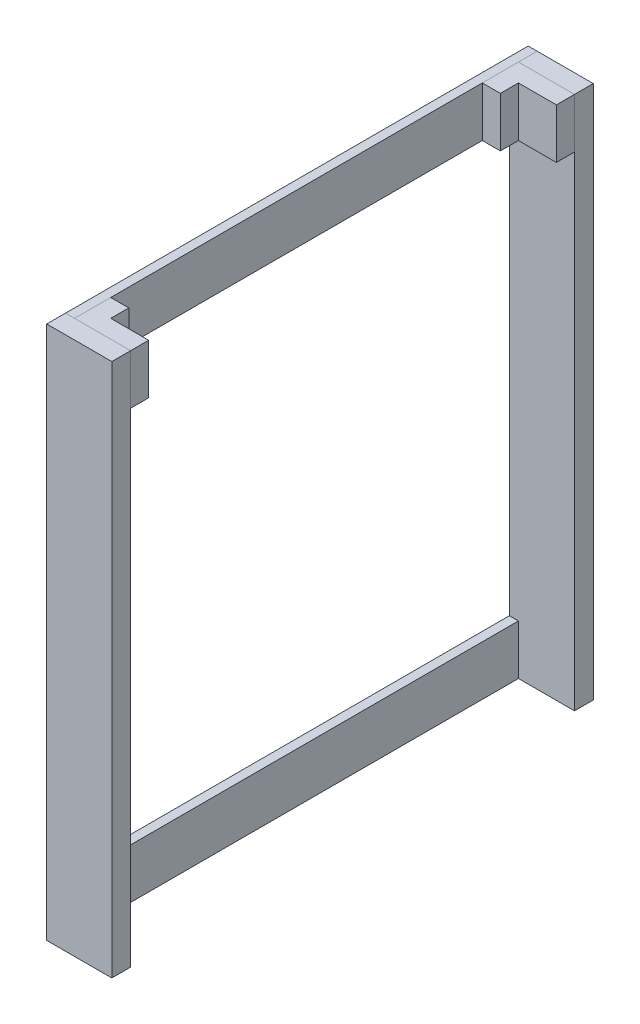
ISO-10303-21;
HEADER;
FILE_DESCRIPTION(('STEP AP214'),'2;1');
FILE_NAME('part.step','',(''),(''),'','','');
FILE_SCHEMA(('AUTOMOTIVE_DESIGN { 1 0 10303 214 1 1 1 1 }'));
ENDSEC;
DATA;
#1=APPLICATION_CONTEXT('core data for automotive mechanical design processes');
#2=APPLICATION_PROTOCOL_DEFINITION('international standard','automotive_design',2000,#1);
#3=PRODUCT_CONTEXT('',#1,'mechanical');
#4=PRODUCT('Part','Part','',(#3));
#5=PRODUCT_RELATED_PRODUCT_CATEGORY('part','',(#4));
#6=PRODUCT_DEFINITION_FORMATION('','',#4);
#7=PRODUCT_DEFINITION_CONTEXT('part definition',#1,'design');
#8=PRODUCT_DEFINITION('design','',#6,#7);
#9=PRODUCT_DEFINITION_SHAPE('','',#8);
#10=(LENGTH_UNIT() NAMED_UNIT(*) SI_UNIT(.MILLI.,.METRE.));
#11=(NAMED_UNIT(*) PLANE_ANGLE_UNIT() SI_UNIT($,.RADIAN.));
#12=(NAMED_UNIT(*) SI_UNIT($,.STERADIAN.) SOLID_ANGLE_UNIT());
#13=UNCERTAINTY_MEASURE_WITH_UNIT(LENGTH_MEASURE(1.E-05),#10,'distance_accuracy_value','');
#14=(GEOMETRIC_REPRESENTATION_CONTEXT(3) GLOBAL_UNCERTAINTY_ASSIGNED_CONTEXT((#13)) GLOBAL_UNIT_ASSIGNED_CONTEXT((#10,
#11,#12)) REPRESENTATION_CONTEXT('',''));
#15=CARTESIAN_POINT('',(0.,0.,0.));
#16=DIRECTION('',(0.,0.,1.));
#17=DIRECTION('',(1.,0.,0.));
#18=AXIS2_PLACEMENT_3D('',#15,#16,#17);
#19=CARTESIAN_POINT('',(-610.,-192.729333728484,307.));
#20=DIRECTION('',(1.,0.,0.));
#21=DIRECTION('',(0.,0.,-1.));
#22=AXIS2_PLACEMENT_3D('',#19,#20,#21);
#23=PLANE('',#22);
#24=DIRECTION('',(0.,0.,1.));
#25=VECTOR('',#24,1.);
#26=CARTESIAN_POINT('',(-610.,-100.5,307.));
#27=LINE('',#26,#25);
#28=CARTESIAN_POINT('',(-610.,-100.5,282.));
#29=VERTEX_POINT('',#28);
#30=CARTESIAN_POINT('',(-610.,-100.5,307.));
#31=VERTEX_POINT('',#30);
#32=EDGE_CURVE('E53',#29,#31,#27,.T.);
#33=ORIENTED_EDGE('',*,*,#32,.F.);
#34=DIRECTION('',(0.,1.,0.));
#35=VECTOR('',#34,1.);
#36=CARTESIAN_POINT('',(-610.,-192.729333728484,282.));
#37=LINE('',#36,#35);
#38=CARTESIAN_POINT('',(-610.,-31.5,282.));
#39=VERTEX_POINT('',#38);
#40=EDGE_CURVE('E109',#29,#39,#37,.T.);
#41=ORIENTED_EDGE('',*,*,#40,.T.);
#42=DIRECTION('',(0.,0.,-1.));
#43=VECTOR('',#42,1.);
#44=CARTESIAN_POINT('',(-610.,-31.5,307.));
#45=LINE('',#44,#43);
#46=CARTESIAN_POINT('',(-610.,-31.5,307.));
#47=VERTEX_POINT('',#46);
#48=EDGE_CURVE('E134',#47,#39,#45,.T.);
#49=ORIENTED_EDGE('',*,*,#48,.F.);
#50=DIRECTION('',(0.,1.,0.));
#51=VECTOR('',#50,1.);
#52=CARTESIAN_POINT('',(-610.,-192.729333728484,307.));
#53=LINE('',#52,#51);
#54=EDGE_CURVE('E102',#31,#47,#53,.T.);
#55=ORIENTED_EDGE('',*,*,#54,.F.);
#56=EDGE_LOOP('',(#33,#41,#49,#55));
#57=FACE_BOUND('',#56,.T.);
#58=ADVANCED_FACE('F45',(#57),#23,.T.);
#59=CARTESIAN_POINT('',(-610.,-192.729333728484,307.));
#60=DIRECTION('',(0.,0.,1.));
#61=DIRECTION('',(1.,0.,0.));
#62=AXIS2_PLACEMENT_3D('',#59,#60,#61);
#63=PLANE('',#62);
#64=DIRECTION('',(-1.,0.,0.));
#65=VECTOR('',#64,1.);
#66=CARTESIAN_POINT('',(-610.,-100.5,307.));
#67=LINE('',#66,#65);
#68=CARTESIAN_POINT('',(-687.5,-100.5,307.));
#69=VERTEX_POINT('',#68);
#70=EDGE_CURVE('E78',#31,#69,#67,.T.);
#71=ORIENTED_EDGE('',*,*,#70,.F.);
#72=ORIENTED_EDGE('',*,*,#54,.T.);
#73=DIRECTION('',(1.,0.,0.));
#74=VECTOR('',#73,1.);
#75=CARTESIAN_POINT('',(-610.,-31.5,307.));
#76=LINE('',#75,#74);
#77=CARTESIAN_POINT('',(-687.5,-31.5,307.));
#78=VERTEX_POINT('',#77);
#79=EDGE_CURVE('E111',#78,#47,#76,.T.);
#80=ORIENTED_EDGE('',*,*,#79,.F.);
#81=DIRECTION('',(0.,1.,0.));
#82=VECTOR('',#81,1.);
#83=CARTESIAN_POINT('',(-687.5,-192.729333728484,307.));
#84=LINE('',#83,#82);
#85=EDGE_CURVE('E100',#69,#78,#84,.T.);
#86=ORIENTED_EDGE('',*,*,#85,.F.);
#87=EDGE_LOOP('',(#71,#72,#80,#86));
#88=FACE_BOUND('',#87,.T.);
#89=ADVANCED_FACE('F152',(#88),#63,.T.);
#90=CARTESIAN_POINT('',(-687.5,-192.729333728484,307.));
#91=DIRECTION('',(-1.,0.,0.));
#92=DIRECTION('',(0.,0.,1.));
#93=AXIS2_PLACEMENT_3D('',#90,#91,#92);
#94=PLANE('',#93);
#95=DIRECTION('',(0.,0.,-1.));
#96=VECTOR('',#95,1.);
#97=CARTESIAN_POINT('',(-687.5,-100.5,307.));
#98=LINE('',#97,#96);
#99=CARTESIAN_POINT('',(-687.5,-100.5,257.));
#100=VERTEX_POINT('',#99);
#101=EDGE_CURVE('E72',#69,#100,#98,.T.);
#102=ORIENTED_EDGE('',*,*,#101,.F.);
#103=ORIENTED_EDGE('',*,*,#85,.T.);
#104=DIRECTION('',(0.,0.,1.));
#105=VECTOR('',#104,1.);
#106=CARTESIAN_POINT('',(-687.5,-31.5,307.));
#107=LINE('',#106,#105);
#108=CARTESIAN_POINT('',(-687.5,-31.5,257.));
#109=VERTEX_POINT('',#108);
#110=EDGE_CURVE('E98',#109,#78,#107,.T.);
#111=ORIENTED_EDGE('',*,*,#110,.F.);
#112=DIRECTION('',(0.,1.,0.));
#113=VECTOR('',#112,1.);
#114=CARTESIAN_POINT('',(-687.5,-192.729333728484,257.));
#115=LINE('',#114,#113);
#116=EDGE_CURVE('E90',#100,#109,#115,.T.);
#117=ORIENTED_EDGE('',*,*,#116,.F.);
#118=EDGE_LOOP('',(#102,#103,#111,#117));
#119=FACE_BOUND('',#118,.T.);
#120=ADVANCED_FACE('F96',(#119),#94,.T.);
#121=CARTESIAN_POINT('',(-687.5,-192.729333728484,257.));
#122=DIRECTION('',(0.,0.,-1.));
#123=DIRECTION('',(-1.,0.,0.));
#124=AXIS2_PLACEMENT_3D('',#121,#122,#123);
#125=PLANE('',#124);
#126=DIRECTION('',(1.,0.,0.));
#127=VECTOR('',#126,1.);
#128=CARTESIAN_POINT('',(-687.5,-100.5,257.));
#129=LINE('',#128,#127);
#130=CARTESIAN_POINT('',(-662.5,-100.5,257.));
#131=VERTEX_POINT('',#130);
#132=EDGE_CURVE('E75',#100,#131,#129,.T.);
#133=ORIENTED_EDGE('',*,*,#132,.F.);
#134=ORIENTED_EDGE('',*,*,#116,.T.);
#135=DIRECTION('',(-1.,0.,0.));
#136=VECTOR('',#135,1.);
#137=CARTESIAN_POINT('',(-687.5,-31.5,257.));
#138=LINE('',#137,#136);
#139=CARTESIAN_POINT('',(-662.5,-31.5,257.));
#140=VERTEX_POINT('',#139);
#141=EDGE_CURVE('E123',#140,#109,#138,.T.);
#142=ORIENTED_EDGE('',*,*,#141,.F.);
#143=DIRECTION('',(0.,1.,0.));
#144=VECTOR('',#143,1.);
#145=CARTESIAN_POINT('',(-662.5,-192.729333728484,257.));
#146=LINE('',#145,#144);
#147=EDGE_CURVE('E93',#131,#140,#146,.T.);
#148=ORIENTED_EDGE('',*,*,#147,.F.);
#149=EDGE_LOOP('',(#133,#134,#142,#148));
#150=FACE_BOUND('',#149,.T.);
#151=ADVANCED_FACE('F87',(#150),#125,.T.);
#152=CARTESIAN_POINT('',(-662.5,-192.729333728484,257.));
#153=DIRECTION('',(1.,0.,0.));
#154=DIRECTION('',(0.,0.,-1.));
#155=AXIS2_PLACEMENT_3D('',#152,#153,#154);
#156=PLANE('',#155);
#157=DIRECTION('',(0.,0.,1.));
#158=VECTOR('',#157,1.);
#159=CARTESIAN_POINT('',(-662.5,-100.5,257.));
#160=LINE('',#159,#158);
#161=CARTESIAN_POINT('',(-662.5,-100.5,282.));
#162=VERTEX_POINT('',#161);
#163=EDGE_CURVE('E94',#131,#162,#160,.T.);
#164=ORIENTED_EDGE('',*,*,#163,.F.);
#165=ORIENTED_EDGE('',*,*,#147,.T.);
#166=DIRECTION('',(0.,0.,-1.));
#167=VECTOR('',#166,1.);
#168=CARTESIAN_POINT('',(-662.5,-31.5,257.));
#169=LINE('',#168,#167);
#170=CARTESIAN_POINT('',(-662.5,-31.5,282.));
#171=VERTEX_POINT('',#170);
#172=EDGE_CURVE('E139',#171,#140,#169,.T.);
#173=ORIENTED_EDGE('',*,*,#172,.F.);
#174=DIRECTION('',(0.,1.,0.));
#175=VECTOR('',#174,1.);
#176=CARTESIAN_POINT('',(-662.5,-192.729333728484,282.));
#177=LINE('',#176,#175);
#178=EDGE_CURVE('E104',#162,#171,#177,.T.);
#179=ORIENTED_EDGE('',*,*,#178,.F.);
#180=EDGE_LOOP('',(#164,#165,#173,#179));
#181=FACE_BOUND('',#180,.T.);
#182=ADVANCED_FACE('F155',(#181),#156,.T.);
#183=CARTESIAN_POINT('',(-610.,-192.729333728484,282.));
#184=DIRECTION('',(0.,0.,-1.));
#185=DIRECTION('',(-1.,0.,0.));
#186=AXIS2_PLACEMENT_3D('',#183,#184,#185);
#187=PLANE('',#186);
#188=DIRECTION('',(1.,0.,0.));
#189=VECTOR('',#188,1.);
#190=CARTESIAN_POINT('',(-610.,-100.5,282.));
#191=LINE('',#190,#189);
#192=EDGE_CURVE('E13',#162,#29,#191,.T.);
#193=ORIENTED_EDGE('',*,*,#192,.F.);
#194=ORIENTED_EDGE('',*,*,#178,.T.);
#195=DIRECTION('',(-1.,0.,0.));
#196=VECTOR('',#195,1.);
#197=CARTESIAN_POINT('',(-610.,-31.5,282.));
#198=LINE('',#197,#196);
#199=EDGE_CURVE('E136',#39,#171,#198,.T.);
#200=ORIENTED_EDGE('',*,*,#199,.F.);
#201=ORIENTED_EDGE('',*,*,#40,.F.);
#202=EDGE_LOOP('',(#193,#194,#200,#201));
#203=FACE_BOUND('',#202,.T.);
#204=ADVANCED_FACE('F154',(#203),#187,.T.);
#205=CARTESIAN_POINT('',(-610.,-31.5,282.));
#206=DIRECTION('',(0.,1.,0.));
#207=DIRECTION('',(0.,0.,1.));
#208=AXIS2_PLACEMENT_3D('',#205,#206,#207);
#209=PLANE('',#208);
#210=ORIENTED_EDGE('',*,*,#48,.T.);
#211=ORIENTED_EDGE('',*,*,#199,.T.);
#212=ORIENTED_EDGE('',*,*,#172,.T.);
#213=ORIENTED_EDGE('',*,*,#141,.T.);
#214=ORIENTED_EDGE('',*,*,#110,.T.);
#215=ORIENTED_EDGE('',*,*,#79,.T.);
#216=EDGE_LOOP('',(#210,#211,#212,#213,#214,#215));
#217=FACE_BOUND('',#216,.T.);
#218=ADVANCED_FACE('F141',(#217),#209,.T.);
#219=CARTESIAN_POINT('',(-700.,-100.5,403.123106035029));
#220=DIRECTION('',(0.,1.,0.));
#221=DIRECTION('',(0.,0.,1.));
#222=AXIS2_PLACEMENT_3D('',#219,#220,#221);
#223=PLANE('',#222);
#224=ORIENTED_EDGE('',*,*,#32,.T.);
#225=ORIENTED_EDGE('',*,*,#70,.T.);
#226=ORIENTED_EDGE('',*,*,#101,.T.);
#227=ORIENTED_EDGE('',*,*,#132,.T.);
#228=ORIENTED_EDGE('',*,*,#163,.T.);
#229=ORIENTED_EDGE('',*,*,#192,.T.);
#230=EDGE_LOOP('',(#224,#225,#226,#227,#228,#229));
#231=FACE_BOUND('',#230,.T.);
#232=ADVANCED_FACE('F74',(#231),#223,.F.);
#233=CLOSED_SHELL('',(#58,#89,#120,#151,#182,#204,#218,#232));
#234=MANIFOLD_SOLID_BREP('B2',#233);
#235=CARTESIAN_POINT('',(-610.,-192.729333728484,-307.));
#236=DIRECTION('',(1.,0.,0.));
#237=DIRECTION('',(0.,0.,-1.));
#238=AXIS2_PLACEMENT_3D('',#235,#236,#237);
#239=PLANE('',#238);
#240=DIRECTION('',(0.,0.,1.));
#241=VECTOR('',#240,1.);
#242=CARTESIAN_POINT('',(-610.,-100.5,-307.));
#243=LINE('',#242,#241);
#244=CARTESIAN_POINT('',(-610.,-100.5,-307.));
#245=VERTEX_POINT('',#244);
#246=CARTESIAN_POINT('',(-610.,-100.5,-282.));
#247=VERTEX_POINT('',#246);
#248=EDGE_CURVE('E242',#245,#247,#243,.T.);
#249=ORIENTED_EDGE('',*,*,#248,.F.);
#250=DIRECTION('',(0.,1.,0.));
#251=VECTOR('',#250,1.);
#252=CARTESIAN_POINT('',(-610.,-192.729333728484,-307.));
#253=LINE('',#252,#251);
#254=CARTESIAN_POINT('',(-610.,-31.5,-307.));
#255=VERTEX_POINT('',#254);
#256=EDGE_CURVE('E298',#245,#255,#253,.T.);
#257=ORIENTED_EDGE('',*,*,#256,.T.);
#258=DIRECTION('',(0.,0.,-1.));
#259=VECTOR('',#258,1.);
#260=CARTESIAN_POINT('',(-610.,-31.5,-307.));
#261=LINE('',#260,#259);
#262=CARTESIAN_POINT('',(-610.,-31.5,-282.));
#263=VERTEX_POINT('',#262);
#264=EDGE_CURVE('E323',#263,#255,#261,.T.);
#265=ORIENTED_EDGE('',*,*,#264,.F.);
#266=DIRECTION('',(0.,1.,0.));
#267=VECTOR('',#266,1.);
#268=CARTESIAN_POINT('',(-610.,-192.729333728484,-282.));
#269=LINE('',#268,#267);
#270=EDGE_CURVE('E291',#247,#263,#269,.T.);
#271=ORIENTED_EDGE('',*,*,#270,.F.);
#272=EDGE_LOOP('',(#249,#257,#265,#271));
#273=FACE_BOUND('',#272,.T.);
#274=ADVANCED_FACE('F234',(#273),#239,.T.);
#275=CARTESIAN_POINT('',(-610.,-192.729333728484,-282.));
#276=DIRECTION('',(0.,0.,1.));
#277=DIRECTION('',(1.,0.,0.));
#278=AXIS2_PLACEMENT_3D('',#275,#276,#277);
#279=PLANE('',#278);
#280=DIRECTION('',(-1.,0.,0.));
#281=VECTOR('',#280,1.);
#282=CARTESIAN_POINT('',(-610.,-100.5,-282.));
#283=LINE('',#282,#281);
#284=CARTESIAN_POINT('',(-662.5,-100.5,-282.));
#285=VERTEX_POINT('',#284);
#286=EDGE_CURVE('E267',#247,#285,#283,.T.);
#287=ORIENTED_EDGE('',*,*,#286,.F.);
#288=ORIENTED_EDGE('',*,*,#270,.T.);
#289=DIRECTION('',(1.,0.,0.));
#290=VECTOR('',#289,1.);
#291=CARTESIAN_POINT('',(-610.,-31.5,-282.));
#292=LINE('',#291,#290);
#293=CARTESIAN_POINT('',(-662.5,-31.5,-282.));
#294=VERTEX_POINT('',#293);
#295=EDGE_CURVE('E300',#294,#263,#292,.T.);
#296=ORIENTED_EDGE('',*,*,#295,.F.);
#297=DIRECTION('',(0.,1.,0.));
#298=VECTOR('',#297,1.);
#299=CARTESIAN_POINT('',(-662.5,-192.729333728484,-282.));
#300=LINE('',#299,#298);
#301=EDGE_CURVE('E289',#285,#294,#300,.T.);
#302=ORIENTED_EDGE('',*,*,#301,.F.);
#303=EDGE_LOOP('',(#287,#288,#296,#302));
#304=FACE_BOUND('',#303,.T.);
#305=ADVANCED_FACE('F341',(#304),#279,.T.);
#306=CARTESIAN_POINT('',(-662.5,-192.729333728484,-257.));
#307=DIRECTION('',(1.,0.,0.));
#308=DIRECTION('',(0.,0.,-1.));
#309=AXIS2_PLACEMENT_3D('',#306,#307,#308);
#310=PLANE('',#309);
#311=DIRECTION('',(0.,0.,1.));
#312=VECTOR('',#311,1.);
#313=CARTESIAN_POINT('',(-662.5,-100.5,-257.));
#314=LINE('',#313,#312);
#315=CARTESIAN_POINT('',(-662.5,-100.5,-257.));
#316=VERTEX_POINT('',#315);
#317=EDGE_CURVE('E261',#285,#316,#314,.T.);
#318=ORIENTED_EDGE('',*,*,#317,.F.);
#319=ORIENTED_EDGE('',*,*,#301,.T.);
#320=DIRECTION('',(0.,0.,-1.));
#321=VECTOR('',#320,1.);
#322=CARTESIAN_POINT('',(-662.5,-31.5,-257.));
#323=LINE('',#322,#321);
#324=CARTESIAN_POINT('',(-662.5,-31.5,-257.));
#325=VERTEX_POINT('',#324);
#326=EDGE_CURVE('E287',#325,#294,#323,.T.);
#327=ORIENTED_EDGE('',*,*,#326,.F.);
#328=DIRECTION('',(0.,1.,0.));
#329=VECTOR('',#328,1.);
#330=CARTESIAN_POINT('',(-662.5,-192.729333728484,-257.));
#331=LINE('',#330,#329);
#332=EDGE_CURVE('E279',#316,#325,#331,.T.);
#333=ORIENTED_EDGE('',*,*,#332,.F.);
#334=EDGE_LOOP('',(#318,#319,#327,#333));
#335=FACE_BOUND('',#334,.T.);
#336=ADVANCED_FACE('F285',(#335),#310,.T.);
#337=CARTESIAN_POINT('',(-687.5,-192.729333728484,-257.));
#338=DIRECTION('',(0.,0.,1.));
#339=DIRECTION('',(1.,0.,0.));
#340=AXIS2_PLACEMENT_3D('',#337,#338,#339);
#341=PLANE('',#340);
#342=DIRECTION('',(-1.,0.,0.));
#343=VECTOR('',#342,1.);
#344=CARTESIAN_POINT('',(-687.5,-100.5,-257.));
#345=LINE('',#344,#343);
#346=CARTESIAN_POINT('',(-687.5,-100.5,-257.));
#347=VERTEX_POINT('',#346);
#348=EDGE_CURVE('E264',#316,#347,#345,.T.);
#349=ORIENTED_EDGE('',*,*,#348,.F.);
#350=ORIENTED_EDGE('',*,*,#332,.T.);
#351=DIRECTION('',(1.,0.,0.));
#352=VECTOR('',#351,1.);
#353=CARTESIAN_POINT('',(-687.5,-31.5,-257.));
#354=LINE('',#353,#352);
#355=CARTESIAN_POINT('',(-687.5,-31.5,-257.));
#356=VERTEX_POINT('',#355);
#357=EDGE_CURVE('E312',#356,#325,#354,.T.);
#358=ORIENTED_EDGE('',*,*,#357,.F.);
#359=DIRECTION('',(0.,1.,0.));
#360=VECTOR('',#359,1.);
#361=CARTESIAN_POINT('',(-687.5,-192.729333728484,-257.));
#362=LINE('',#361,#360);
#363=EDGE_CURVE('E282',#347,#356,#362,.T.);
#364=ORIENTED_EDGE('',*,*,#363,.F.);
#365=EDGE_LOOP('',(#349,#350,#358,#364));
#366=FACE_BOUND('',#365,.T.);
#367=ADVANCED_FACE('F276',(#366),#341,.T.);
#368=CARTESIAN_POINT('',(-687.5,-192.729333728484,-282.));
#369=DIRECTION('',(-1.,0.,0.));
#370=DIRECTION('',(0.,0.,1.));
#371=AXIS2_PLACEMENT_3D('',#368,#369,#370);
#372=PLANE('',#371);
#373=DIRECTION('',(0.,0.,-1.));
#374=VECTOR('',#373,1.);
#375=CARTESIAN_POINT('',(-687.5,-100.5,-282.));
#376=LINE('',#375,#374);
#377=CARTESIAN_POINT('',(-687.5,-100.5,-307.));
#378=VERTEX_POINT('',#377);
#379=EDGE_CURVE('E283',#347,#378,#376,.T.);
#380=ORIENTED_EDGE('',*,*,#379,.F.);
#381=ORIENTED_EDGE('',*,*,#363,.T.);
#382=DIRECTION('',(0.,0.,1.));
#383=VECTOR('',#382,1.);
#384=CARTESIAN_POINT('',(-687.5,-31.5,-282.));
#385=LINE('',#384,#383);
#386=CARTESIAN_POINT('',(-687.5,-31.5,-307.));
#387=VERTEX_POINT('',#386);
#388=EDGE_CURVE('E328',#387,#356,#385,.T.);
#389=ORIENTED_EDGE('',*,*,#388,.F.);
#390=DIRECTION('',(0.,1.,0.));
#391=VECTOR('',#390,1.);
#392=CARTESIAN_POINT('',(-687.5,-192.729333728484,-307.));
#393=LINE('',#392,#391);
#394=EDGE_CURVE('E293',#378,#387,#393,.T.);
#395=ORIENTED_EDGE('',*,*,#394,.F.);
#396=EDGE_LOOP('',(#380,#381,#389,#395));
#397=FACE_BOUND('',#396,.T.);
#398=ADVANCED_FACE('F344',(#397),#372,.T.);
#399=CARTESIAN_POINT('',(-610.,-192.729333728484,-307.));
#400=DIRECTION('',(0.,0.,-1.));
#401=DIRECTION('',(-1.,0.,0.));
#402=AXIS2_PLACEMENT_3D('',#399,#400,#401);
#403=PLANE('',#402);
#404=DIRECTION('',(1.,0.,0.));
#405=VECTOR('',#404,1.);
#406=CARTESIAN_POINT('',(-610.,-100.5,-307.));
#407=LINE('',#406,#405);
#408=EDGE_CURVE('E43',#378,#245,#407,.T.);
#409=ORIENTED_EDGE('',*,*,#408,.F.);
#410=ORIENTED_EDGE('',*,*,#394,.T.);
#411=DIRECTION('',(-1.,0.,0.));
#412=VECTOR('',#411,1.);
#413=CARTESIAN_POINT('',(-610.,-31.5,-307.));
#414=LINE('',#413,#412);
#415=EDGE_CURVE('E325',#255,#387,#414,.T.);
#416=ORIENTED_EDGE('',*,*,#415,.F.);
#417=ORIENTED_EDGE('',*,*,#256,.F.);
#418=EDGE_LOOP('',(#409,#410,#416,#417));
#419=FACE_BOUND('',#418,.T.);
#420=ADVANCED_FACE('F343',(#419),#403,.T.);
#421=CARTESIAN_POINT('',(-610.,-31.5,-282.));
#422=DIRECTION('',(0.,-1.,0.));
#423=DIRECTION('',(0.,0.,-1.));
#424=AXIS2_PLACEMENT_3D('',#421,#422,#423);
#425=PLANE('',#424);
#426=ORIENTED_EDGE('',*,*,#264,.T.);
#427=ORIENTED_EDGE('',*,*,#415,.T.);
#428=ORIENTED_EDGE('',*,*,#388,.T.);
#429=ORIENTED_EDGE('',*,*,#357,.T.);
#430=ORIENTED_EDGE('',*,*,#326,.T.);
#431=ORIENTED_EDGE('',*,*,#295,.T.);
#432=EDGE_LOOP('',(#426,#427,#428,#429,#430,#431));
#433=FACE_BOUND('',#432,.T.);
#434=ADVANCED_FACE('F330',(#433),#425,.F.);
#435=CARTESIAN_POINT('',(-700.,-100.5,403.123106035029));
#436=DIRECTION('',(0.,1.,0.));
#437=DIRECTION('',(0.,0.,1.));
#438=AXIS2_PLACEMENT_3D('',#435,#436,#437);
#439=PLANE('',#438);
#440=ORIENTED_EDGE('',*,*,#248,.T.);
#441=ORIENTED_EDGE('',*,*,#286,.T.);
#442=ORIENTED_EDGE('',*,*,#317,.T.);
#443=ORIENTED_EDGE('',*,*,#348,.T.);
#444=ORIENTED_EDGE('',*,*,#379,.T.);
#445=ORIENTED_EDGE('',*,*,#408,.T.);
#446=EDGE_LOOP('',(#440,#441,#442,#443,#444,#445));
#447=FACE_BOUND('',#446,.T.);
#448=ADVANCED_FACE('F263',(#447),#439,.F.);
#449=CLOSED_SHELL('',(#274,#305,#336,#367,#398,#420,#434,#448));
#450=MANIFOLD_SOLID_BREP('B7',#449);
#451=CARTESIAN_POINT('',(-700.,-701.,403.123106035029));
#452=DIRECTION('',(0.,-1.,0.));
#453=DIRECTION('',(0.,0.,-1.));
#454=AXIS2_PLACEMENT_3D('',#451,#452,#453);
#455=PLANE('',#454);
#456=DIRECTION('',(0.,0.,-1.));
#457=VECTOR('',#456,1.);
#458=CARTESIAN_POINT('',(-700.,-701.,403.123106035029));
#459=LINE('',#458,#457);
#460=CARTESIAN_POINT('',(-700.,-701.,333.));
#461=VERTEX_POINT('',#460);
#462=CARTESIAN_POINT('',(-700.,-701.,-333.));
#463=VERTEX_POINT('',#462);
#464=EDGE_CURVE('E484',#461,#463,#459,.T.);
#465=ORIENTED_EDGE('',*,*,#464,.F.);
#466=DIRECTION('',(1.,0.,0.));
#467=VECTOR('',#466,1.);
#468=CARTESIAN_POINT('',(-700.,-701.,333.));
#469=LINE('',#468,#467);
#470=CARTESIAN_POINT('',(-687.5,-701.,333.));
#471=VERTEX_POINT('',#470);
#472=EDGE_CURVE('E427',#461,#471,#469,.T.);
#473=ORIENTED_EDGE('',*,*,#472,.T.);
#474=DIRECTION('',(0.,0.,-1.));
#475=VECTOR('',#474,1.);
#476=CARTESIAN_POINT('',(-687.5,-701.,403.123106035029));
#477=LINE('',#476,#475);
#478=CARTESIAN_POINT('',(-687.5,-701.,-333.));
#479=VERTEX_POINT('',#478);
#480=EDGE_CURVE('E471',#471,#479,#477,.T.);
#481=ORIENTED_EDGE('',*,*,#480,.T.);
#482=DIRECTION('',(1.,0.,0.));
#483=VECTOR('',#482,1.);
#484=CARTESIAN_POINT('',(-700.,-701.,-333.));
#485=LINE('',#484,#483);
#486=EDGE_CURVE('E481',#463,#479,#485,.T.);
#487=ORIENTED_EDGE('',*,*,#486,.F.);
#488=EDGE_LOOP('',(#465,#473,#481,#487));
#489=FACE_BOUND('',#488,.T.);
#490=ADVANCED_FACE('F423',(#489),#455,.F.);
#491=CARTESIAN_POINT('',(-687.5,-770.,403.123106035029));
#492=DIRECTION('',(-1.,0.,0.));
#493=DIRECTION('',(0.,-1.,0.));
#494=AXIS2_PLACEMENT_3D('',#491,#492,#493);
#495=PLANE('',#494);
#496=ORIENTED_EDGE('',*,*,#480,.F.);
#497=DIRECTION('',(0.,-1.,0.));
#498=VECTOR('',#497,1.);
#499=CARTESIAN_POINT('',(-687.5,-770.,333.));
#500=LINE('',#499,#498);
#501=CARTESIAN_POINT('',(-687.5,-770.,333.));
#502=VERTEX_POINT('',#501);
#503=EDGE_CURVE('E467',#471,#502,#500,.T.);
#504=ORIENTED_EDGE('',*,*,#503,.T.);
#505=DIRECTION('',(0.,0.,-1.));
#506=VECTOR('',#505,1.);
#507=CARTESIAN_POINT('',(-687.5,-770.,403.123106035029));
#508=LINE('',#507,#506);
#509=CARTESIAN_POINT('',(-687.5,-770.,-333.));
#510=VERTEX_POINT('',#509);
#511=EDGE_CURVE('E462',#502,#510,#508,.T.);
#512=ORIENTED_EDGE('',*,*,#511,.T.);
#513=DIRECTION('',(0.,-1.,0.));
#514=VECTOR('',#513,1.);
#515=CARTESIAN_POINT('',(-687.5,-770.,-333.));
#516=LINE('',#515,#514);
#517=EDGE_CURVE('E466',#479,#510,#516,.T.);
#518=ORIENTED_EDGE('',*,*,#517,.F.);
#519=EDGE_LOOP('',(#496,#504,#512,#518));
#520=FACE_BOUND('',#519,.T.);
#521=ADVANCED_FACE('F465',(#520),#495,.F.);
#522=CARTESIAN_POINT('',(-700.,-770.,403.123106035029));
#523=DIRECTION('',(0.,1.,0.));
#524=DIRECTION('',(0.,0.,1.));
#525=AXIS2_PLACEMENT_3D('',#522,#523,#524);
#526=PLANE('',#525);
#527=ORIENTED_EDGE('',*,*,#511,.F.);
#528=DIRECTION('',(-1.,0.,0.));
#529=VECTOR('',#528,1.);
#530=CARTESIAN_POINT('',(-700.,-770.,333.));
#531=LINE('',#530,#529);
#532=CARTESIAN_POINT('',(-700.,-770.,333.));
#533=VERTEX_POINT('',#532);
#534=EDGE_CURVE('E432',#502,#533,#531,.T.);
#535=ORIENTED_EDGE('',*,*,#534,.T.);
#536=DIRECTION('',(0.,0.,-1.));
#537=VECTOR('',#536,1.);
#538=CARTESIAN_POINT('',(-700.,-770.,403.123106035029));
#539=LINE('',#538,#537);
#540=CARTESIAN_POINT('',(-700.,-770.,-333.));
#541=VERTEX_POINT('',#540);
#542=EDGE_CURVE('E470',#533,#541,#539,.T.);
#543=ORIENTED_EDGE('',*,*,#542,.T.);
#544=DIRECTION('',(-1.,0.,0.));
#545=VECTOR('',#544,1.);
#546=CARTESIAN_POINT('',(-700.,-770.,-333.));
#547=LINE('',#546,#545);
#548=EDGE_CURVE('E478',#510,#541,#547,.T.);
#549=ORIENTED_EDGE('',*,*,#548,.F.);
#550=EDGE_LOOP('',(#527,#535,#543,#549));
#551=FACE_BOUND('',#550,.T.);
#552=ADVANCED_FACE('F483',(#551),#526,.F.);
#553=CARTESIAN_POINT('',(-700.,-770.,403.123106035029));
#554=DIRECTION('',(1.,0.,0.));
#555=DIRECTION('',(0.,0.,-1.));
#556=AXIS2_PLACEMENT_3D('',#553,#554,#555);
#557=PLANE('',#556);
#558=ORIENTED_EDGE('',*,*,#542,.F.);
#559=DIRECTION('',(0.,1.,0.));
#560=VECTOR('',#559,1.);
#561=CARTESIAN_POINT('',(-700.,-770.,333.));
#562=LINE('',#561,#560);
#563=EDGE_CURVE('E232',#533,#461,#562,.T.);
#564=ORIENTED_EDGE('',*,*,#563,.T.);
#565=ORIENTED_EDGE('',*,*,#464,.T.);
#566=DIRECTION('',(0.,1.,0.));
#567=VECTOR('',#566,1.);
#568=CARTESIAN_POINT('',(-700.,-770.,-333.));
#569=LINE('',#568,#567);
#570=EDGE_CURVE('E485',#541,#463,#569,.T.);
#571=ORIENTED_EDGE('',*,*,#570,.F.);
#572=EDGE_LOOP('',(#558,#564,#565,#571));
#573=FACE_BOUND('',#572,.T.);
#574=ADVANCED_FACE('F425',(#573),#557,.F.);
#575=CARTESIAN_POINT('',(-700.,93.6803074290429,333.));
#576=DIRECTION('',(0.,0.,-1.));
#577=DIRECTION('',(-1.,0.,0.));
#578=AXIS2_PLACEMENT_3D('',#575,#576,#577);
#579=PLANE('',#578);
#580=ORIENTED_EDGE('',*,*,#534,.F.);
#581=ORIENTED_EDGE('',*,*,#503,.F.);
#582=ORIENTED_EDGE('',*,*,#472,.F.);
#583=ORIENTED_EDGE('',*,*,#563,.F.);
#584=EDGE_LOOP('',(#580,#581,#582,#583));
#585=FACE_BOUND('',#584,.T.);
#586=ADVANCED_FACE('F496',(#585),#579,.F.);
#587=CARTESIAN_POINT('',(-700.,93.6803074290429,-333.));
#588=DIRECTION('',(0.,0.,1.));
#589=DIRECTION('',(1.,0.,0.));
#590=AXIS2_PLACEMENT_3D('',#587,#588,#589);
#591=PLANE('',#590);
#592=ORIENTED_EDGE('',*,*,#570,.T.);
#593=ORIENTED_EDGE('',*,*,#486,.T.);
#594=ORIENTED_EDGE('',*,*,#517,.T.);
#595=ORIENTED_EDGE('',*,*,#548,.T.);
#596=EDGE_LOOP('',(#592,#593,#594,#595));
#597=FACE_BOUND('',#596,.T.);
#598=ADVANCED_FACE('F477',(#597),#591,.F.);
#599=CLOSED_SHELL('',(#490,#521,#552,#574,#586,#598));
#600=MANIFOLD_SOLID_BREP('B37',#599);
#601=CARTESIAN_POINT('',(-700.,-31.4999999999999,403.123106035029));
#602=DIRECTION('',(0.,-1.,0.));
#603=DIRECTION('',(0.,0.,-1.));
#604=AXIS2_PLACEMENT_3D('',#601,#602,#603);
#605=PLANE('',#604);
#606=DIRECTION('',(0.,0.,-1.));
#607=VECTOR('',#606,1.);
#608=CARTESIAN_POINT('',(-700.,-31.4999999999999,403.123106035029));
#609=LINE('',#608,#607);
#610=CARTESIAN_POINT('',(-700.,-31.4999999999999,333.));
#611=VERTEX_POINT('',#610);
#612=CARTESIAN_POINT('',(-700.,-31.4999999999999,-333.));
#613=VERTEX_POINT('',#612);
#614=EDGE_CURVE('E618',#611,#613,#609,.T.);
#615=ORIENTED_EDGE('',*,*,#614,.F.);
#616=DIRECTION('',(1.,0.,0.));
#617=VECTOR('',#616,1.);
#618=CARTESIAN_POINT('',(-700.,-31.4999999999999,333.));
#619=LINE('',#618,#617);
#620=CARTESIAN_POINT('',(-687.5,-31.4999999999999,333.));
#621=VERTEX_POINT('',#620);
#622=EDGE_CURVE('E561',#611,#621,#619,.T.);
#623=ORIENTED_EDGE('',*,*,#622,.T.);
#624=DIRECTION('',(0.,0.,-1.));
#625=VECTOR('',#624,1.);
#626=CARTESIAN_POINT('',(-687.5,-31.4999999999999,403.123106035029));
#627=LINE('',#626,#625);
#628=CARTESIAN_POINT('',(-687.5,-31.4999999999999,-333.));
#629=VERTEX_POINT('',#628);
#630=EDGE_CURVE('E605',#621,#629,#627,.T.);
#631=ORIENTED_EDGE('',*,*,#630,.T.);
#632=DIRECTION('',(1.,0.,0.));
#633=VECTOR('',#632,1.);
#634=CARTESIAN_POINT('',(-700.,-31.4999999999999,-333.));
#635=LINE('',#634,#633);
#636=EDGE_CURVE('E615',#613,#629,#635,.T.);
#637=ORIENTED_EDGE('',*,*,#636,.F.);
#638=EDGE_LOOP('',(#615,#623,#631,#637));
#639=FACE_BOUND('',#638,.T.);
#640=ADVANCED_FACE('F557',(#639),#605,.F.);
#641=CARTESIAN_POINT('',(-687.5,-31.4999999999999,403.123106035029));
#642=DIRECTION('',(-1.,0.,0.));
#643=DIRECTION('',(0.,0.,1.));
#644=AXIS2_PLACEMENT_3D('',#641,#642,#643);
#645=PLANE('',#644);
#646=ORIENTED_EDGE('',*,*,#630,.F.);
#647=DIRECTION('',(0.,-1.,0.));
#648=VECTOR('',#647,1.);
#649=CARTESIAN_POINT('',(-687.5,-31.4999999999999,333.));
#650=LINE('',#649,#648);
#651=CARTESIAN_POINT('',(-687.5,-100.5,333.));
#652=VERTEX_POINT('',#651);
#653=EDGE_CURVE('E601',#621,#652,#650,.T.);
#654=ORIENTED_EDGE('',*,*,#653,.T.);
#655=DIRECTION('',(0.,0.,-1.));
#656=VECTOR('',#655,1.);
#657=CARTESIAN_POINT('',(-687.5,-100.5,403.123106035029));
#658=LINE('',#657,#656);
#659=CARTESIAN_POINT('',(-687.5,-100.5,-333.));
#660=VERTEX_POINT('',#659);
#661=EDGE_CURVE('E596',#652,#660,#658,.T.);
#662=ORIENTED_EDGE('',*,*,#661,.T.);
#663=DIRECTION('',(0.,-1.,0.));
#664=VECTOR('',#663,1.);
#665=CARTESIAN_POINT('',(-687.5,-31.4999999999999,-333.));
#666=LINE('',#665,#664);
#667=EDGE_CURVE('E600',#629,#660,#666,.T.);
#668=ORIENTED_EDGE('',*,*,#667,.F.);
#669=EDGE_LOOP('',(#646,#654,#662,#668));
#670=FACE_BOUND('',#669,.T.);
#671=ADVANCED_FACE('F599',(#670),#645,.F.);
#672=CARTESIAN_POINT('',(-700.,-100.5,403.123106035029));
#673=DIRECTION('',(0.,1.,0.));
#674=DIRECTION('',(0.,0.,1.));
#675=AXIS2_PLACEMENT_3D('',#672,#673,#674);
#676=PLANE('',#675);
#677=ORIENTED_EDGE('',*,*,#661,.F.);
#678=DIRECTION('',(-1.,0.,0.));
#679=VECTOR('',#678,1.);
#680=CARTESIAN_POINT('',(-700.,-100.5,333.));
#681=LINE('',#680,#679);
#682=CARTESIAN_POINT('',(-700.,-100.5,333.));
#683=VERTEX_POINT('',#682);
#684=EDGE_CURVE('E566',#652,#683,#681,.T.);
#685=ORIENTED_EDGE('',*,*,#684,.T.);
#686=DIRECTION('',(0.,0.,-1.));
#687=VECTOR('',#686,1.);
#688=CARTESIAN_POINT('',(-700.,-100.5,403.123106035029));
#689=LINE('',#688,#687);
#690=CARTESIAN_POINT('',(-700.,-100.5,-333.));
#691=VERTEX_POINT('',#690);
#692=EDGE_CURVE('E604',#683,#691,#689,.T.);
#693=ORIENTED_EDGE('',*,*,#692,.T.);
#694=DIRECTION('',(-1.,0.,0.));
#695=VECTOR('',#694,1.);
#696=CARTESIAN_POINT('',(-700.,-100.5,-333.));
#697=LINE('',#696,#695);
#698=EDGE_CURVE('E612',#660,#691,#697,.T.);
#699=ORIENTED_EDGE('',*,*,#698,.F.);
#700=EDGE_LOOP('',(#677,#685,#693,#699));
#701=FACE_BOUND('',#700,.T.);
#702=ADVANCED_FACE('F617',(#701),#676,.F.);
#703=CARTESIAN_POINT('',(-700.,-31.4999999999999,403.123106035029));
#704=DIRECTION('',(1.,0.,0.));
#705=DIRECTION('',(0.,0.,-1.));
#706=AXIS2_PLACEMENT_3D('',#703,#704,#705);
#707=PLANE('',#706);
#708=ORIENTED_EDGE('',*,*,#692,.F.);
#709=DIRECTION('',(0.,1.,0.));
#710=VECTOR('',#709,1.);
#711=CARTESIAN_POINT('',(-700.,-31.4999999999999,333.));
#712=LINE('',#711,#710);
#713=EDGE_CURVE('E421',#683,#611,#712,.T.);
#714=ORIENTED_EDGE('',*,*,#713,.T.);
#715=ORIENTED_EDGE('',*,*,#614,.T.);
#716=DIRECTION('',(0.,1.,0.));
#717=VECTOR('',#716,1.);
#718=CARTESIAN_POINT('',(-700.,-31.4999999999999,-333.));
#719=LINE('',#718,#717);
#720=EDGE_CURVE('E619',#691,#613,#719,.T.);
#721=ORIENTED_EDGE('',*,*,#720,.F.);
#722=EDGE_LOOP('',(#708,#714,#715,#721));
#723=FACE_BOUND('',#722,.T.);
#724=ADVANCED_FACE('F559',(#723),#707,.F.);
#725=CARTESIAN_POINT('',(-700.,93.6803074290429,333.));
#726=DIRECTION('',(0.,0.,-1.));
#727=DIRECTION('',(-1.,0.,0.));
#728=AXIS2_PLACEMENT_3D('',#725,#726,#727);
#729=PLANE('',#728);
#730=ORIENTED_EDGE('',*,*,#684,.F.);
#731=ORIENTED_EDGE('',*,*,#653,.F.);
#732=ORIENTED_EDGE('',*,*,#622,.F.);
#733=ORIENTED_EDGE('',*,*,#713,.F.);
#734=EDGE_LOOP('',(#730,#731,#732,#733));
#735=FACE_BOUND('',#734,.T.);
#736=ADVANCED_FACE('F630',(#735),#729,.F.);
#737=CARTESIAN_POINT('',(-700.,93.6803074290429,-333.));
#738=DIRECTION('',(0.,0.,1.));
#739=DIRECTION('',(1.,0.,0.));
#740=AXIS2_PLACEMENT_3D('',#737,#738,#739);
#741=PLANE('',#740);
#742=ORIENTED_EDGE('',*,*,#720,.T.);
#743=ORIENTED_EDGE('',*,*,#636,.T.);
#744=ORIENTED_EDGE('',*,*,#667,.T.);
#745=ORIENTED_EDGE('',*,*,#698,.T.);
#746=EDGE_LOOP('',(#742,#743,#744,#745));
#747=FACE_BOUND('',#746,.T.);
#748=ADVANCED_FACE('F611',(#747),#741,.F.);
#749=CLOSED_SHELL('',(#640,#671,#702,#724,#736,#748));
#750=MANIFOLD_SOLID_BREP('B226',#749);
#751=CARTESIAN_POINT('',(-700.,93.6803074290429,-333.));
#752=DIRECTION('',(1.,0.,0.));
#753=DIRECTION('',(0.,0.,-1.));
#754=AXIS2_PLACEMENT_3D('',#751,#752,#753);
#755=PLANE('',#754);
#756=DIRECTION('',(0.,0.,1.));
#757=VECTOR('',#756,1.);
#758=CARTESIAN_POINT('',(-700.,-31.5,-333.));
#759=LINE('',#758,#757);
#760=CARTESIAN_POINT('',(-700.,-31.5,-333.));
#761=VERTEX_POINT('',#760);
#762=CARTESIAN_POINT('',(-700.,-31.5,-307.));
#763=VERTEX_POINT('',#762);
#764=EDGE_CURVE('E740',#761,#763,#759,.T.);
#765=ORIENTED_EDGE('',*,*,#764,.F.);
#766=DIRECTION('',(0.,-1.,0.));
#767=VECTOR('',#766,1.);
#768=CARTESIAN_POINT('',(-700.,93.6803074290429,-333.));
#769=LINE('',#768,#767);
#770=CARTESIAN_POINT('',(-700.,-770.,-333.));
#771=VERTEX_POINT('',#770);
#772=EDGE_CURVE('E694',#761,#771,#769,.T.);
#773=ORIENTED_EDGE('',*,*,#772,.T.);
#774=DIRECTION('',(0.,0.,1.));
#775=VECTOR('',#774,1.);
#776=CARTESIAN_POINT('',(-700.,-770.,-333.));
#777=LINE('',#776,#775);
#778=CARTESIAN_POINT('',(-700.,-770.,-307.));
#779=VERTEX_POINT('',#778);
#780=EDGE_CURVE('E738',#771,#779,#777,.T.);
#781=ORIENTED_EDGE('',*,*,#780,.T.);
#782=DIRECTION('',(0.,-1.,0.));
#783=VECTOR('',#782,1.);
#784=CARTESIAN_POINT('',(-700.,93.6803074290429,-307.));
#785=LINE('',#784,#783);
#786=EDGE_CURVE('E729',#763,#779,#785,.T.);
#787=ORIENTED_EDGE('',*,*,#786,.F.);
#788=EDGE_LOOP('',(#765,#773,#781,#787));
#789=FACE_BOUND('',#788,.T.);
#790=ADVANCED_FACE('F690',(#789),#755,.F.);
#791=CARTESIAN_POINT('',(-700.,93.6803074290429,-307.));
#792=DIRECTION('',(0.,0.,-1.));
#793=DIRECTION('',(-1.,0.,0.));
#794=AXIS2_PLACEMENT_3D('',#791,#792,#793);
#795=PLANE('',#794);
#796=DIRECTION('',(1.,0.,0.));
#797=VECTOR('',#796,1.);
#798=CARTESIAN_POINT('',(-700.,-31.5,-307.));
#799=LINE('',#798,#797);
#800=CARTESIAN_POINT('',(-610.,-31.5,-307.));
#801=VERTEX_POINT('',#800);
#802=EDGE_CURVE('E699',#763,#801,#799,.T.);
#803=ORIENTED_EDGE('',*,*,#802,.F.);
#804=ORIENTED_EDGE('',*,*,#786,.T.);
#805=DIRECTION('',(1.,0.,0.));
#806=VECTOR('',#805,1.);
#807=CARTESIAN_POINT('',(-700.,-770.,-307.));
#808=LINE('',#807,#806);
#809=CARTESIAN_POINT('',(-610.,-770.,-307.));
#810=VERTEX_POINT('',#809);
#811=EDGE_CURVE('E750',#779,#810,#808,.T.);
#812=ORIENTED_EDGE('',*,*,#811,.T.);
#813=DIRECTION('',(0.,-1.,0.));
#814=VECTOR('',#813,1.);
#815=CARTESIAN_POINT('',(-610.,93.6803074290429,-307.));
#816=LINE('',#815,#814);
#817=EDGE_CURVE('E759',#801,#810,#816,.T.);
#818=ORIENTED_EDGE('',*,*,#817,.F.);
#819=EDGE_LOOP('',(#803,#804,#812,#818));
#820=FACE_BOUND('',#819,.T.);
#821=ADVANCED_FACE('F763',(#820),#795,.F.);
#822=CARTESIAN_POINT('',(-610.,93.6803074290429,-333.));
#823=DIRECTION('',(-1.,0.,0.));
#824=DIRECTION('',(0.,0.,1.));
#825=AXIS2_PLACEMENT_3D('',#822,#823,#824);
#826=PLANE('',#825);
#827=DIRECTION('',(0.,0.,-1.));
#828=VECTOR('',#827,1.);
#829=CARTESIAN_POINT('',(-610.,-31.5,-333.));
#830=LINE('',#829,#828);
#831=CARTESIAN_POINT('',(-610.,-31.5,-333.));
#832=VERTEX_POINT('',#831);
#833=EDGE_CURVE('E555',#801,#832,#830,.T.);
#834=ORIENTED_EDGE('',*,*,#833,.F.);
#835=ORIENTED_EDGE('',*,*,#817,.T.);
#836=DIRECTION('',(0.,0.,-1.));
#837=VECTOR('',#836,1.);
#838=CARTESIAN_POINT('',(-610.,-770.,-333.));
#839=LINE('',#838,#837);
#840=CARTESIAN_POINT('',(-610.,-770.,-333.));
#841=VERTEX_POINT('',#840);
#842=EDGE_CURVE('E760',#810,#841,#839,.T.);
#843=ORIENTED_EDGE('',*,*,#842,.T.);
#844=DIRECTION('',(0.,-1.,0.));
#845=VECTOR('',#844,1.);
#846=CARTESIAN_POINT('',(-610.,93.6803074290429,-333.));
#847=LINE('',#846,#845);
#848=EDGE_CURVE('E712',#832,#841,#847,.T.);
#849=ORIENTED_EDGE('',*,*,#848,.F.);
#850=EDGE_LOOP('',(#834,#835,#843,#849));
#851=FACE_BOUND('',#850,.T.);
#852=ADVANCED_FACE('F762',(#851),#826,.F.);
#853=CARTESIAN_POINT('',(-700.,93.6803074290429,-333.));
#854=DIRECTION('',(0.,0.,1.));
#855=DIRECTION('',(1.,0.,0.));
#856=AXIS2_PLACEMENT_3D('',#853,#854,#855);
#857=PLANE('',#856);
#858=DIRECTION('',(-1.,0.,0.));
#859=VECTOR('',#858,1.);
#860=CARTESIAN_POINT('',(-700.,-31.5,-333.));
#861=LINE('',#860,#859);
#862=EDGE_CURVE('E747',#832,#761,#861,.T.);
#863=ORIENTED_EDGE('',*,*,#862,.F.);
#864=ORIENTED_EDGE('',*,*,#848,.T.);
#865=DIRECTION('',(-1.,0.,0.));
#866=VECTOR('',#865,1.);
#867=CARTESIAN_POINT('',(-700.,-770.,-333.));
#868=LINE('',#867,#866);
#869=EDGE_CURVE('E743',#841,#771,#868,.T.);
#870=ORIENTED_EDGE('',*,*,#869,.T.);
#871=ORIENTED_EDGE('',*,*,#772,.F.);
#872=EDGE_LOOP('',(#863,#864,#870,#871));
#873=FACE_BOUND('',#872,.T.);
#874=ADVANCED_FACE('F744',(#873),#857,.F.);
#875=CARTESIAN_POINT('',(-700.,-770.,-307.));
#876=DIRECTION('',(0.,1.,0.));
#877=DIRECTION('',(0.,0.,1.));
#878=AXIS2_PLACEMENT_3D('',#875,#876,#877);
#879=PLANE('',#878);
#880=ORIENTED_EDGE('',*,*,#780,.F.);
#881=ORIENTED_EDGE('',*,*,#869,.F.);
#882=ORIENTED_EDGE('',*,*,#842,.F.);
#883=ORIENTED_EDGE('',*,*,#811,.F.);
#884=EDGE_LOOP('',(#880,#881,#882,#883));
#885=FACE_BOUND('',#884,.T.);
#886=ADVANCED_FACE('F749',(#885),#879,.F.);
#887=CARTESIAN_POINT('',(0.,-31.5,0.));
#888=DIRECTION('',(0.,1.,0.));
#889=DIRECTION('',(0.,0.,1.));
#890=AXIS2_PLACEMENT_3D('',#887,#888,#889);
#891=PLANE('',#890);
#892=ORIENTED_EDGE('',*,*,#862,.T.);
#893=ORIENTED_EDGE('',*,*,#764,.T.);
#894=ORIENTED_EDGE('',*,*,#802,.T.);
#895=ORIENTED_EDGE('',*,*,#833,.T.);
#896=EDGE_LOOP('',(#892,#893,#894,#895));
#897=FACE_BOUND('',#896,.T.);
#898=ADVANCED_FACE('F692',(#897),#891,.T.);
#899=CLOSED_SHELL('',(#790,#821,#852,#874,#886,#898));
#900=MANIFOLD_SOLID_BREP('B415',#899);
#901=CARTESIAN_POINT('',(-700.,93.6803074290429,333.));
#902=DIRECTION('',(1.,0.,0.));
#903=DIRECTION('',(0.,0.,-1.));
#904=AXIS2_PLACEMENT_3D('',#901,#902,#903);
#905=PLANE('',#904);
#906=DIRECTION('',(0.,0.,1.));
#907=VECTOR('',#906,1.);
#908=CARTESIAN_POINT('',(-700.,-31.5,333.));
#909=LINE('',#908,#907);
#910=CARTESIAN_POINT('',(-700.,-31.5,307.));
#911=VERTEX_POINT('',#910);
#912=CARTESIAN_POINT('',(-700.,-31.5,333.));
#913=VERTEX_POINT('',#912);
#914=EDGE_CURVE('E864',#911,#913,#909,.T.);
#915=ORIENTED_EDGE('',*,*,#914,.F.);
#916=DIRECTION('',(0.,-1.,0.));
#917=VECTOR('',#916,1.);
#918=CARTESIAN_POINT('',(-700.,93.6803074290429,307.));
#919=LINE('',#918,#917);
#920=CARTESIAN_POINT('',(-700.,-770.,307.));
#921=VERTEX_POINT('',#920);
#922=EDGE_CURVE('E818',#911,#921,#919,.T.);
#923=ORIENTED_EDGE('',*,*,#922,.T.);
#924=DIRECTION('',(0.,0.,1.));
#925=VECTOR('',#924,1.);
#926=CARTESIAN_POINT('',(-700.,-770.,333.));
#927=LINE('',#926,#925);
#928=CARTESIAN_POINT('',(-700.,-770.,333.));
#929=VERTEX_POINT('',#928);
#930=EDGE_CURVE('E862',#921,#929,#927,.T.);
#931=ORIENTED_EDGE('',*,*,#930,.T.);
#932=DIRECTION('',(0.,-1.,0.));
#933=VECTOR('',#932,1.);
#934=CARTESIAN_POINT('',(-700.,93.6803074290429,333.));
#935=LINE('',#934,#933);
#936=EDGE_CURVE('E853',#913,#929,#935,.T.);
#937=ORIENTED_EDGE('',*,*,#936,.F.);
#938=EDGE_LOOP('',(#915,#923,#931,#937));
#939=FACE_BOUND('',#938,.T.);
#940=ADVANCED_FACE('F814',(#939),#905,.F.);
#941=CARTESIAN_POINT('',(-700.,93.6803074290429,333.));
#942=DIRECTION('',(0.,0.,-1.));
#943=DIRECTION('',(-1.,0.,0.));
#944=AXIS2_PLACEMENT_3D('',#941,#942,#943);
#945=PLANE('',#944);
#946=DIRECTION('',(1.,0.,0.));
#947=VECTOR('',#946,1.);
#948=CARTESIAN_POINT('',(-700.,-31.5,333.));
#949=LINE('',#948,#947);
#950=CARTESIAN_POINT('',(-610.,-31.5,333.));
#951=VERTEX_POINT('',#950);
#952=EDGE_CURVE('E823',#913,#951,#949,.T.);
#953=ORIENTED_EDGE('',*,*,#952,.F.);
#954=ORIENTED_EDGE('',*,*,#936,.T.);
#955=DIRECTION('',(1.,0.,0.));
#956=VECTOR('',#955,1.);
#957=CARTESIAN_POINT('',(-700.,-770.,333.));
#958=LINE('',#957,#956);
#959=CARTESIAN_POINT('',(-610.,-770.,333.));
#960=VERTEX_POINT('',#959);
#961=EDGE_CURVE('E874',#929,#960,#958,.T.);
#962=ORIENTED_EDGE('',*,*,#961,.T.);
#963=DIRECTION('',(0.,-1.,0.));
#964=VECTOR('',#963,1.);
#965=CARTESIAN_POINT('',(-610.,93.6803074290429,333.));
#966=LINE('',#965,#964);
#967=EDGE_CURVE('E883',#951,#960,#966,.T.);
#968=ORIENTED_EDGE('',*,*,#967,.F.);
#969=EDGE_LOOP('',(#953,#954,#962,#968));
#970=FACE_BOUND('',#969,.T.);
#971=ADVANCED_FACE('F887',(#970),#945,.F.);
#972=CARTESIAN_POINT('',(-610.,93.6803074290429,333.));
#973=DIRECTION('',(-1.,0.,0.));
#974=DIRECTION('',(0.,0.,1.));
#975=AXIS2_PLACEMENT_3D('',#972,#973,#974);
#976=PLANE('',#975);
#977=DIRECTION('',(0.,0.,-1.));
#978=VECTOR('',#977,1.);
#979=CARTESIAN_POINT('',(-610.,-31.5,333.));
#980=LINE('',#979,#978);
#981=CARTESIAN_POINT('',(-610.,-31.5,307.));
#982=VERTEX_POINT('',#981);
#983=EDGE_CURVE('E688',#951,#982,#980,.T.);
#984=ORIENTED_EDGE('',*,*,#983,.F.);
#985=ORIENTED_EDGE('',*,*,#967,.T.);
#986=DIRECTION('',(0.,0.,-1.));
#987=VECTOR('',#986,1.);
#988=CARTESIAN_POINT('',(-610.,-770.,333.));
#989=LINE('',#988,#987);
#990=CARTESIAN_POINT('',(-610.,-770.,307.));
#991=VERTEX_POINT('',#990);
#992=EDGE_CURVE('E884',#960,#991,#989,.T.);
#993=ORIENTED_EDGE('',*,*,#992,.T.);
#994=DIRECTION('',(0.,-1.,0.));
#995=VECTOR('',#994,1.);
#996=CARTESIAN_POINT('',(-610.,93.6803074290429,307.));
#997=LINE('',#996,#995);
#998=EDGE_CURVE('E836',#982,#991,#997,.T.);
#999=ORIENTED_EDGE('',*,*,#998,.F.);
#1000=EDGE_LOOP('',(#984,#985,#993,#999));
#1001=FACE_BOUND('',#1000,.T.);
#1002=ADVANCED_FACE('F886',(#1001),#976,.F.);
#1003=CARTESIAN_POINT('',(-700.,93.6803074290429,307.));
#1004=DIRECTION('',(0.,0.,1.));
#1005=DIRECTION('',(1.,0.,0.));
#1006=AXIS2_PLACEMENT_3D('',#1003,#1004,#1005);
#1007=PLANE('',#1006);
#1008=DIRECTION('',(-1.,0.,0.));
#1009=VECTOR('',#1008,1.);
#1010=CARTESIAN_POINT('',(-700.,-31.5,307.));
#1011=LINE('',#1010,#1009);
#1012=EDGE_CURVE('E871',#982,#911,#1011,.T.);
#1013=ORIENTED_EDGE('',*,*,#1012,.F.);
#1014=ORIENTED_EDGE('',*,*,#998,.T.);
#1015=DIRECTION('',(-1.,0.,0.));
#1016=VECTOR('',#1015,1.);
#1017=CARTESIAN_POINT('',(-700.,-770.,307.));
#1018=LINE('',#1017,#1016);
#1019=EDGE_CURVE('E867',#991,#921,#1018,.T.);
#1020=ORIENTED_EDGE('',*,*,#1019,.T.);
#1021=ORIENTED_EDGE('',*,*,#922,.F.);
#1022=EDGE_LOOP('',(#1013,#1014,#1020,#1021));
#1023=FACE_BOUND('',#1022,.T.);
#1024=ADVANCED_FACE('F868',(#1023),#1007,.F.);
#1025=CARTESIAN_POINT('',(-700.,-770.,307.));
#1026=DIRECTION('',(0.,-1.,0.));
#1027=DIRECTION('',(0.,0.,-1.));
#1028=AXIS2_PLACEMENT_3D('',#1025,#1026,#1027);
#1029=PLANE('',#1028);
#1030=ORIENTED_EDGE('',*,*,#930,.F.);
#1031=ORIENTED_EDGE('',*,*,#1019,.F.);
#1032=ORIENTED_EDGE('',*,*,#992,.F.);
#1033=ORIENTED_EDGE('',*,*,#961,.F.);
#1034=EDGE_LOOP('',(#1030,#1031,#1032,#1033));
#1035=FACE_BOUND('',#1034,.T.);
#1036=ADVANCED_FACE('F873',(#1035),#1029,.T.);
#1037=CARTESIAN_POINT('',(0.,-31.5,0.));
#1038=DIRECTION('',(0.,1.,0.));
#1039=DIRECTION('',(0.,0.,1.));
#1040=AXIS2_PLACEMENT_3D('',#1037,#1038,#1039);
#1041=PLANE('',#1040);
#1042=ORIENTED_EDGE('',*,*,#1012,.T.);
#1043=ORIENTED_EDGE('',*,*,#914,.T.);
#1044=ORIENTED_EDGE('',*,*,#952,.T.);
#1045=ORIENTED_EDGE('',*,*,#983,.T.);
#1046=EDGE_LOOP('',(#1042,#1043,#1044,#1045));
#1047=FACE_BOUND('',#1046,.T.);
#1048=ADVANCED_FACE('F816',(#1047),#1041,.T.);
#1049=CLOSED_SHELL('',(#940,#971,#1002,#1024,#1036,#1048));
#1050=MANIFOLD_SOLID_BREP('B549',#1049);
#1051=ADVANCED_BREP_SHAPE_REPRESENTATION('',(#18,#234,#450,#600,#750,#900,#1050),#14);
#1052=SHAPE_DEFINITION_REPRESENTATION(#9,#1051);
ENDSEC;
END-ISO-10303-21;
